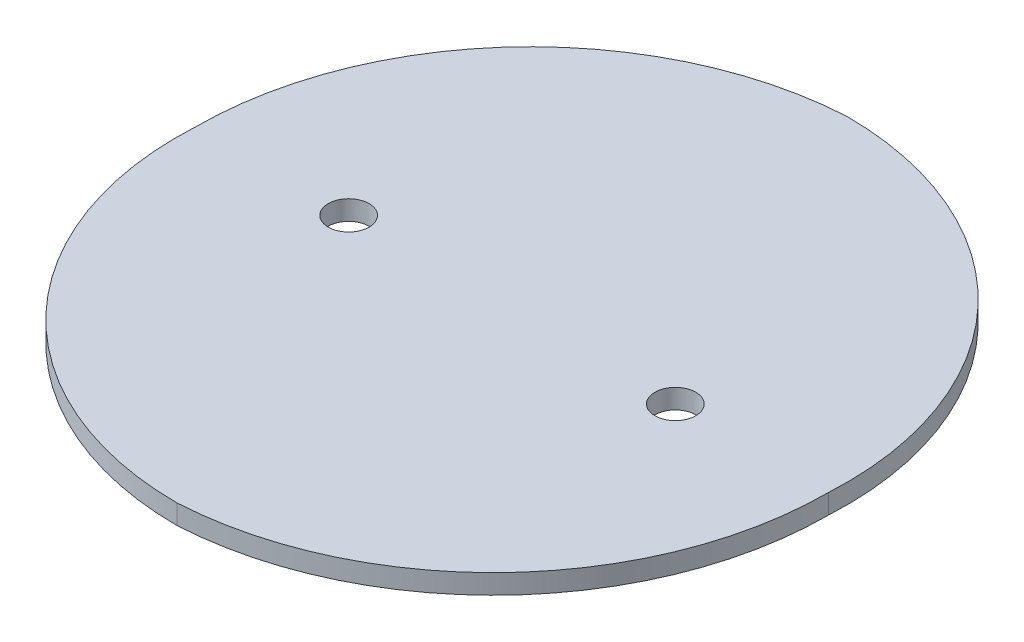
ISO-10303-21;
HEADER;
FILE_DESCRIPTION(('STEP AP214'),'2;1');
FILE_NAME('part.step','',(''),(''),'','','');
FILE_SCHEMA(('AUTOMOTIVE_DESIGN { 1 0 10303 214 1 1 1 1 }'));
ENDSEC;
DATA;
#1=APPLICATION_CONTEXT('core data for automotive mechanical design processes');
#2=APPLICATION_PROTOCOL_DEFINITION('international standard','automotive_design',2000,#1);
#3=PRODUCT_CONTEXT('',#1,'mechanical');
#4=PRODUCT('Part','Part','',(#3));
#5=PRODUCT_RELATED_PRODUCT_CATEGORY('part','',(#4));
#6=PRODUCT_DEFINITION_FORMATION('','',#4);
#7=PRODUCT_DEFINITION_CONTEXT('part definition',#1,'design');
#8=PRODUCT_DEFINITION('design','',#6,#7);
#9=PRODUCT_DEFINITION_SHAPE('','',#8);
#10=(LENGTH_UNIT() NAMED_UNIT(*) SI_UNIT(.MILLI.,.METRE.));
#11=(NAMED_UNIT(*) PLANE_ANGLE_UNIT() SI_UNIT($,.RADIAN.));
#12=(NAMED_UNIT(*) SI_UNIT($,.STERADIAN.) SOLID_ANGLE_UNIT());
#13=UNCERTAINTY_MEASURE_WITH_UNIT(LENGTH_MEASURE(1.E-05),#10,'distance_accuracy_value','');
#14=(GEOMETRIC_REPRESENTATION_CONTEXT(3) GLOBAL_UNCERTAINTY_ASSIGNED_CONTEXT((#13)) GLOBAL_UNIT_ASSIGNED_CONTEXT((#10,
#11,#12)) REPRESENTATION_CONTEXT('',''));
#15=CARTESIAN_POINT('',(0.,0.,0.));
#16=DIRECTION('',(0.,0.,1.));
#17=DIRECTION('',(1.,0.,0.));
#18=AXIS2_PLACEMENT_3D('',#15,#16,#17);
#19=CARTESIAN_POINT('',(0.,3.,-5.44702439024389));
#20=DIRECTION('',(0.,-1.,0.));
#21=DIRECTION('',(0.,0.,-1.));
#22=AXIS2_PLACEMENT_3D('',#19,#20,#21);
#23=CYLINDRICAL_SURFACE('',#22,97.0529756097561);
#24=CARTESIAN_POINT('',(0.,-3.,-5.44702439024389));
#25=DIRECTION('',(0.,1.,0.));
#26=DIRECTION('',(0.,0.,-1.));
#27=AXIS2_PLACEMENT_3D('',#24,#25,#26);
#28=CIRCLE('',#27,97.0529756097561);
#29=CARTESIAN_POINT('',(96.9,-3.,0.));
#30=VERTEX_POINT('',#29);
#31=CARTESIAN_POINT('',(0.,-3.,-102.5));
#32=VERTEX_POINT('',#31);
#33=EDGE_CURVE('E95',#30,#32,#28,.T.);
#34=ORIENTED_EDGE('',*,*,#33,.T.);
#35=DIRECTION('',(0.,-1.,0.));
#36=VECTOR('',#35,1.);
#37=CARTESIAN_POINT('',(0.,3.,-102.5));
#38=LINE('',#37,#36);
#39=CARTESIAN_POINT('',(0.,3.,-102.5));
#40=VERTEX_POINT('',#39);
#41=EDGE_CURVE('E11',#40,#32,#38,.T.);
#42=ORIENTED_EDGE('',*,*,#41,.F.);
#43=CARTESIAN_POINT('',(0.,3.,-5.44702439024389));
#44=DIRECTION('',(0.,1.,0.));
#45=DIRECTION('',(0.,0.,-1.));
#46=AXIS2_PLACEMENT_3D('',#43,#44,#45);
#47=CIRCLE('',#46,97.0529756097561);
#48=CARTESIAN_POINT('',(96.9,3.,0.));
#49=VERTEX_POINT('',#48);
#50=EDGE_CURVE('E83',#49,#40,#47,.T.);
#51=ORIENTED_EDGE('',*,*,#50,.F.);
#52=DIRECTION('',(0.,-1.,0.));
#53=VECTOR('',#52,1.);
#54=CARTESIAN_POINT('',(96.9,3.,0.));
#55=LINE('',#54,#53);
#56=EDGE_CURVE('E91',#49,#30,#55,.T.);
#57=ORIENTED_EDGE('',*,*,#56,.T.);
#58=EDGE_LOOP('',(#34,#42,#51,#57));
#59=FACE_BOUND('',#58,.T.);
#60=ADVANCED_FACE('F32',(#59),#23,.T.);
#61=CARTESIAN_POINT('',(5.76181630546962,3.,0.));
#62=DIRECTION('',(0.,-1.,0.));
#63=DIRECTION('',(0.,0.,-1.));
#64=AXIS2_PLACEMENT_3D('',#61,#62,#63);
#65=CYLINDRICAL_SURFACE('',#64,102.66181630547);
#66=CARTESIAN_POINT('',(5.76181630546962,-3.,0.));
#67=DIRECTION('',(0.,1.,0.));
#68=DIRECTION('',(0.,0.,-1.));
#69=AXIS2_PLACEMENT_3D('',#66,#67,#68);
#70=CIRCLE('',#69,102.66181630547);
#71=CARTESIAN_POINT('',(-96.9,-3.,0.));
#72=VERTEX_POINT('',#71);
#73=EDGE_CURVE('E87',#32,#72,#70,.T.);
#74=ORIENTED_EDGE('',*,*,#73,.T.);
#75=DIRECTION('',(0.,-1.,0.));
#76=VECTOR('',#75,1.);
#77=CARTESIAN_POINT('',(-96.9,3.,0.));
#78=LINE('',#77,#76);
#79=CARTESIAN_POINT('',(-96.9,3.,0.));
#80=VERTEX_POINT('',#79);
#81=EDGE_CURVE('E40',#80,#72,#78,.T.);
#82=ORIENTED_EDGE('',*,*,#81,.F.);
#83=CARTESIAN_POINT('',(5.76181630546962,3.,0.));
#84=DIRECTION('',(0.,1.,0.));
#85=DIRECTION('',(0.,0.,-1.));
#86=AXIS2_PLACEMENT_3D('',#83,#84,#85);
#87=CIRCLE('',#86,102.66181630547);
#88=EDGE_CURVE('E78',#40,#80,#87,.T.);
#89=ORIENTED_EDGE('',*,*,#88,.F.);
#90=ORIENTED_EDGE('',*,*,#41,.T.);
#91=EDGE_LOOP('',(#74,#82,#89,#90));
#92=FACE_BOUND('',#91,.T.);
#93=ADVANCED_FACE('F86',(#92),#65,.T.);
#94=CARTESIAN_POINT('',(0.,3.,5.44702439024386));
#95=DIRECTION('',(0.,-1.,0.));
#96=DIRECTION('',(0.,0.,-1.));
#97=AXIS2_PLACEMENT_3D('',#94,#95,#96);
#98=CYLINDRICAL_SURFACE('',#97,97.0529756097561);
#99=CARTESIAN_POINT('',(0.,-3.,5.44702439024386));
#100=DIRECTION('',(0.,1.,0.));
#101=DIRECTION('',(0.,0.,-1.));
#102=AXIS2_PLACEMENT_3D('',#99,#100,#101);
#103=CIRCLE('',#102,97.0529756097561);
#104=CARTESIAN_POINT('',(0.,-3.,102.5));
#105=VERTEX_POINT('',#104);
#106=EDGE_CURVE('E65',#72,#105,#103,.T.);
#107=ORIENTED_EDGE('',*,*,#106,.T.);
#108=DIRECTION('',(0.,-1.,0.));
#109=VECTOR('',#108,1.);
#110=CARTESIAN_POINT('',(0.,3.,102.5));
#111=LINE('',#110,#109);
#112=CARTESIAN_POINT('',(0.,3.,102.5));
#113=VERTEX_POINT('',#112);
#114=EDGE_CURVE('E88',#113,#105,#111,.T.);
#115=ORIENTED_EDGE('',*,*,#114,.F.);
#116=CARTESIAN_POINT('',(0.,3.,5.44702439024386));
#117=DIRECTION('',(0.,1.,0.));
#118=DIRECTION('',(0.,0.,-1.));
#119=AXIS2_PLACEMENT_3D('',#116,#117,#118);
#120=CIRCLE('',#119,97.0529756097561);
#121=EDGE_CURVE('E81',#80,#113,#120,.T.);
#122=ORIENTED_EDGE('',*,*,#121,.F.);
#123=ORIENTED_EDGE('',*,*,#81,.T.);
#124=EDGE_LOOP('',(#107,#115,#122,#123));
#125=FACE_BOUND('',#124,.T.);
#126=ADVANCED_FACE('F89',(#125),#98,.T.);
#127=CARTESIAN_POINT('',(-5.76181630546951,3.,0.));
#128=DIRECTION('',(0.,-1.,0.));
#129=DIRECTION('',(0.,0.,-1.));
#130=AXIS2_PLACEMENT_3D('',#127,#128,#129);
#131=CYLINDRICAL_SURFACE('',#130,102.66181630547);
#132=CARTESIAN_POINT('',(-5.76181630546951,-3.,0.));
#133=DIRECTION('',(0.,1.,0.));
#134=DIRECTION('',(0.,0.,-1.));
#135=AXIS2_PLACEMENT_3D('',#132,#133,#134);
#136=CIRCLE('',#135,102.66181630547);
#137=EDGE_CURVE('E71',#105,#30,#136,.T.);
#138=ORIENTED_EDGE('',*,*,#137,.T.);
#139=ORIENTED_EDGE('',*,*,#56,.F.);
#140=CARTESIAN_POINT('',(-5.76181630546951,3.,0.));
#141=DIRECTION('',(0.,1.,0.));
#142=DIRECTION('',(0.,0.,-1.));
#143=AXIS2_PLACEMENT_3D('',#140,#141,#142);
#144=CIRCLE('',#143,102.66181630547);
#145=EDGE_CURVE('E48',#113,#49,#144,.T.);
#146=ORIENTED_EDGE('',*,*,#145,.F.);
#147=ORIENTED_EDGE('',*,*,#114,.T.);
#148=EDGE_LOOP('',(#138,#139,#146,#147));
#149=FACE_BOUND('',#148,.T.);
#150=ADVANCED_FACE('F103',(#149),#131,.T.);
#151=CARTESIAN_POINT('',(-2.88090815273475,3.,-2.72351219512193));
#152=DIRECTION('',(0.,-1.,0.));
#153=DIRECTION('',(0.,0.,-1.));
#154=AXIS2_PLACEMENT_3D('',#151,#152,#153);
#155=PLANE('',#154);
#156=CARTESIAN_POINT('',(50.,3.,0.));
#157=DIRECTION('',(0.,1.,0.));
#158=DIRECTION('',(0.,0.,-1.));
#159=AXIS2_PLACEMENT_3D('',#156,#157,#158);
#160=CIRCLE('',#159,6.25000000000001);
#161=CARTESIAN_POINT('',(50.,3.,-6.24999999999998));
#162=VERTEX_POINT('',#161);
#163=EDGE_CURVE('E115',#162,#162,#160,.T.);
#164=ORIENTED_EDGE('',*,*,#163,.F.);
#165=EDGE_LOOP('',(#164));
#166=FACE_BOUND('',#165,.T.);
#167=CARTESIAN_POINT('',(-50.,3.,0.));
#168=DIRECTION('',(0.,1.,0.));
#169=DIRECTION('',(0.,0.,1.));
#170=AXIS2_PLACEMENT_3D('',#167,#168,#169);
#171=CIRCLE('',#170,6.25000000000001);
#172=CARTESIAN_POINT('',(-50.,3.,6.25000000000003));
#173=VERTEX_POINT('',#172);
#174=EDGE_CURVE('E109',#173,#173,#171,.T.);
#175=ORIENTED_EDGE('',*,*,#174,.F.);
#176=EDGE_LOOP('',(#175));
#177=FACE_BOUND('',#176,.T.);
#178=ORIENTED_EDGE('',*,*,#50,.T.);
#179=ORIENTED_EDGE('',*,*,#88,.T.);
#180=ORIENTED_EDGE('',*,*,#121,.T.);
#181=ORIENTED_EDGE('',*,*,#145,.T.);
#182=EDGE_LOOP('',(#178,#179,#180,#181));
#183=FACE_BOUND('',#182,.T.);
#184=ADVANCED_FACE('F79',(#166,#177,#183),#155,.F.);
#185=CARTESIAN_POINT('',(-2.88090815273475,-3.,-2.72351219512193));
#186=DIRECTION('',(0.,-1.,0.));
#187=DIRECTION('',(0.,0.,-1.));
#188=AXIS2_PLACEMENT_3D('',#185,#186,#187);
#189=PLANE('',#188);
#190=CARTESIAN_POINT('',(50.,-3.,0.));
#191=DIRECTION('',(0.,1.,0.));
#192=DIRECTION('',(0.,0.,-1.));
#193=AXIS2_PLACEMENT_3D('',#190,#191,#192);
#194=CIRCLE('',#193,6.25000000000001);
#195=CARTESIAN_POINT('',(50.,-3.,-6.24999999999998));
#196=VERTEX_POINT('',#195);
#197=EDGE_CURVE('E112',#196,#196,#194,.T.);
#198=ORIENTED_EDGE('',*,*,#197,.T.);
#199=EDGE_LOOP('',(#198));
#200=FACE_BOUND('',#199,.T.);
#201=CARTESIAN_POINT('',(-50.,-3.,0.));
#202=DIRECTION('',(0.,1.,0.));
#203=DIRECTION('',(0.,0.,1.));
#204=AXIS2_PLACEMENT_3D('',#201,#202,#203);
#205=CIRCLE('',#204,6.25000000000001);
#206=CARTESIAN_POINT('',(-50.,-3.,6.25000000000003));
#207=VERTEX_POINT('',#206);
#208=EDGE_CURVE('E98',#207,#207,#205,.T.);
#209=ORIENTED_EDGE('',*,*,#208,.T.);
#210=EDGE_LOOP('',(#209));
#211=FACE_BOUND('',#210,.T.);
#212=ORIENTED_EDGE('',*,*,#33,.F.);
#213=ORIENTED_EDGE('',*,*,#137,.F.);
#214=ORIENTED_EDGE('',*,*,#106,.F.);
#215=ORIENTED_EDGE('',*,*,#73,.F.);
#216=EDGE_LOOP('',(#212,#213,#214,#215));
#217=FACE_BOUND('',#216,.T.);
#218=ADVANCED_FACE('F106',(#200,#211,#217),#189,.T.);
#219=CARTESIAN_POINT('',(-50.,-3.,0.));
#220=DIRECTION('',(0.,1.,0.));
#221=DIRECTION('',(0.,0.,1.));
#222=AXIS2_PLACEMENT_3D('',#219,#220,#221);
#223=CYLINDRICAL_SURFACE('',#222,6.25000000000001);
#224=ORIENTED_EDGE('',*,*,#208,.F.);
#225=EDGE_LOOP('',(#224));
#226=FACE_BOUND('',#225,.T.);
#227=ORIENTED_EDGE('',*,*,#174,.T.);
#228=EDGE_LOOP('',(#227));
#229=FACE_BOUND('',#228,.T.);
#230=ADVANCED_FACE('F126',(#226,#229),#223,.F.);
#231=CARTESIAN_POINT('',(50.,-3.,0.));
#232=DIRECTION('',(0.,1.,0.));
#233=DIRECTION('',(0.,0.,1.));
#234=AXIS2_PLACEMENT_3D('',#231,#232,#233);
#235=CYLINDRICAL_SURFACE('',#234,6.25000000000001);
#236=ORIENTED_EDGE('',*,*,#197,.F.);
#237=EDGE_LOOP('',(#236));
#238=FACE_BOUND('',#237,.T.);
#239=ORIENTED_EDGE('',*,*,#163,.T.);
#240=EDGE_LOOP('',(#239));
#241=FACE_BOUND('',#240,.T.);
#242=ADVANCED_FACE('F123',(#238,#241),#235,.F.);
#243=CLOSED_SHELL('',(#60,#93,#126,#150,#184,#218,#230,#242));
#244=MANIFOLD_SOLID_BREP('B2',#243);
#245=ADVANCED_BREP_SHAPE_REPRESENTATION('',(#18,#244),#14);
#246=SHAPE_DEFINITION_REPRESENTATION(#9,#245);
ENDSEC;
END-ISO-10303-21;
